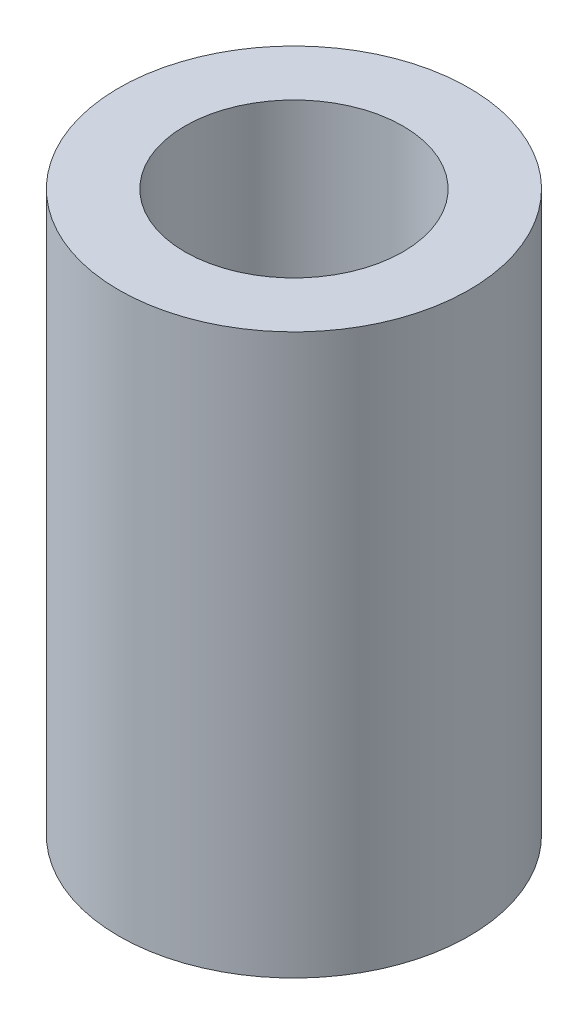
ISO-10303-21;
HEADER;
FILE_DESCRIPTION(('STEP AP214'),'2;1');
FILE_NAME('part.step','',(''),(''),'','','');
FILE_SCHEMA(('AUTOMOTIVE_DESIGN { 1 0 10303 214 1 1 1 1 }'));
ENDSEC;
DATA;
#1=APPLICATION_CONTEXT('core data for automotive mechanical design processes');
#2=APPLICATION_PROTOCOL_DEFINITION('international standard','automotive_design',2000,#1);
#3=PRODUCT_CONTEXT('',#1,'mechanical');
#4=PRODUCT('Part','Part','',(#3));
#5=PRODUCT_RELATED_PRODUCT_CATEGORY('part','',(#4));
#6=PRODUCT_DEFINITION_FORMATION('','',#4);
#7=PRODUCT_DEFINITION_CONTEXT('part definition',#1,'design');
#8=PRODUCT_DEFINITION('design','',#6,#7);
#9=PRODUCT_DEFINITION_SHAPE('','',#8);
#10=(LENGTH_UNIT() NAMED_UNIT(*) SI_UNIT(.MILLI.,.METRE.));
#11=(NAMED_UNIT(*) PLANE_ANGLE_UNIT() SI_UNIT($,.RADIAN.));
#12=(NAMED_UNIT(*) SI_UNIT($,.STERADIAN.) SOLID_ANGLE_UNIT());
#13=UNCERTAINTY_MEASURE_WITH_UNIT(LENGTH_MEASURE(1.E-05),#10,'distance_accuracy_value','');
#14=(GEOMETRIC_REPRESENTATION_CONTEXT(3) GLOBAL_UNCERTAINTY_ASSIGNED_CONTEXT((#13)) GLOBAL_UNIT_ASSIGNED_CONTEXT((#10,
#11,#12)) REPRESENTATION_CONTEXT('',''));
#15=CARTESIAN_POINT('',(0.,0.,0.));
#16=DIRECTION('',(0.,0.,1.));
#17=DIRECTION('',(1.,0.,0.));
#18=AXIS2_PLACEMENT_3D('',#15,#16,#17);
#19=CARTESIAN_POINT('',(0.,31.962113436064,0.));
#20=DIRECTION('',(0.,-1.,0.));
#21=DIRECTION('',(0.,0.,-1.));
#22=AXIS2_PLACEMENT_3D('',#19,#20,#21);
#23=CYLINDRICAL_SURFACE('',#22,10.);
#24=CARTESIAN_POINT('',(0.,31.962113436064,0.));
#25=DIRECTION('',(0.,1.,0.));
#26=DIRECTION('',(0.,0.,1.));
#27=AXIS2_PLACEMENT_3D('',#24,#25,#26);
#28=CIRCLE('',#27,10.);
#29=CARTESIAN_POINT('',(0.,31.962113436064,10.));
#30=VERTEX_POINT('',#29);
#31=EDGE_CURVE('E10',#30,#30,#28,.T.);
#32=ORIENTED_EDGE('',*,*,#31,.F.);
#33=EDGE_LOOP('',(#32));
#34=FACE_BOUND('',#33,.T.);
#35=CARTESIAN_POINT('',(0.,0.,0.));
#36=DIRECTION('',(0.,1.,0.));
#37=DIRECTION('',(0.,0.,1.));
#38=AXIS2_PLACEMENT_3D('',#35,#36,#37);
#39=CIRCLE('',#38,10.);
#40=CARTESIAN_POINT('',(0.,0.,10.));
#41=VERTEX_POINT('',#40);
#42=EDGE_CURVE('E37',#41,#41,#39,.T.);
#43=ORIENTED_EDGE('',*,*,#42,.T.);
#44=EDGE_LOOP('',(#43));
#45=FACE_BOUND('',#44,.T.);
#46=ADVANCED_FACE('F40',(#34,#45),#23,.T.);
#47=CARTESIAN_POINT('',(0.,31.962113436064,0.));
#48=DIRECTION('',(0.,1.,0.));
#49=DIRECTION('',(0.,0.,1.));
#50=AXIS2_PLACEMENT_3D('',#47,#48,#49);
#51=PLANE('',#50);
#52=CARTESIAN_POINT('',(0.,31.962113436064,0.));
#53=DIRECTION('',(0.,1.,0.));
#54=DIRECTION('',(0.,0.,1.));
#55=AXIS2_PLACEMENT_3D('',#52,#53,#54);
#56=CIRCLE('',#55,6.22700816719127);
#57=CARTESIAN_POINT('',(0.,31.962113436064,6.22700816719127));
#58=VERTEX_POINT('',#57);
#59=EDGE_CURVE('E50',#58,#58,#56,.T.);
#60=ORIENTED_EDGE('',*,*,#59,.F.);
#61=EDGE_LOOP('',(#60));
#62=FACE_BOUND('',#61,.T.);
#63=ORIENTED_EDGE('',*,*,#31,.T.);
#64=EDGE_LOOP('',(#63));
#65=FACE_BOUND('',#64,.T.);
#66=ADVANCED_FACE('F59',(#62,#65),#51,.T.);
#67=CARTESIAN_POINT('',(0.,0.,0.));
#68=DIRECTION('',(0.,1.,0.));
#69=DIRECTION('',(0.,0.,1.));
#70=AXIS2_PLACEMENT_3D('',#67,#68,#69);
#71=PLANE('',#70);
#72=CARTESIAN_POINT('',(0.,0.,0.));
#73=DIRECTION('',(0.,1.,0.));
#74=DIRECTION('',(0.,0.,1.));
#75=AXIS2_PLACEMENT_3D('',#72,#73,#74);
#76=CIRCLE('',#75,6.22700816719127);
#77=CARTESIAN_POINT('',(0.,0.,6.22700816719127));
#78=VERTEX_POINT('',#77);
#79=EDGE_CURVE('E47',#78,#78,#76,.T.);
#80=ORIENTED_EDGE('',*,*,#79,.T.);
#81=EDGE_LOOP('',(#80));
#82=FACE_BOUND('',#81,.T.);
#83=ORIENTED_EDGE('',*,*,#42,.F.);
#84=EDGE_LOOP('',(#83));
#85=FACE_BOUND('',#84,.T.);
#86=ADVANCED_FACE('F58',(#82,#85),#71,.F.);
#87=CARTESIAN_POINT('',(0.,31.962113436064,0.));
#88=DIRECTION('',(0.,-1.,0.));
#89=DIRECTION('',(0.,0.,-1.));
#90=AXIS2_PLACEMENT_3D('',#87,#88,#89);
#91=CYLINDRICAL_SURFACE('',#90,6.22700816719127);
#92=ORIENTED_EDGE('',*,*,#59,.T.);
#93=EDGE_LOOP('',(#92));
#94=FACE_BOUND('',#93,.T.);
#95=ORIENTED_EDGE('',*,*,#79,.F.);
#96=EDGE_LOOP('',(#95));
#97=FACE_BOUND('',#96,.T.);
#98=ADVANCED_FACE('F54',(#94,#97),#91,.F.);
#99=CLOSED_SHELL('',(#46,#66,#86,#98));
#100=MANIFOLD_SOLID_BREP('B2',#99);
#101=ADVANCED_BREP_SHAPE_REPRESENTATION('',(#18,#100),#14);
#102=SHAPE_DEFINITION_REPRESENTATION(#9,#101);
ENDSEC;
END-ISO-10303-21;
